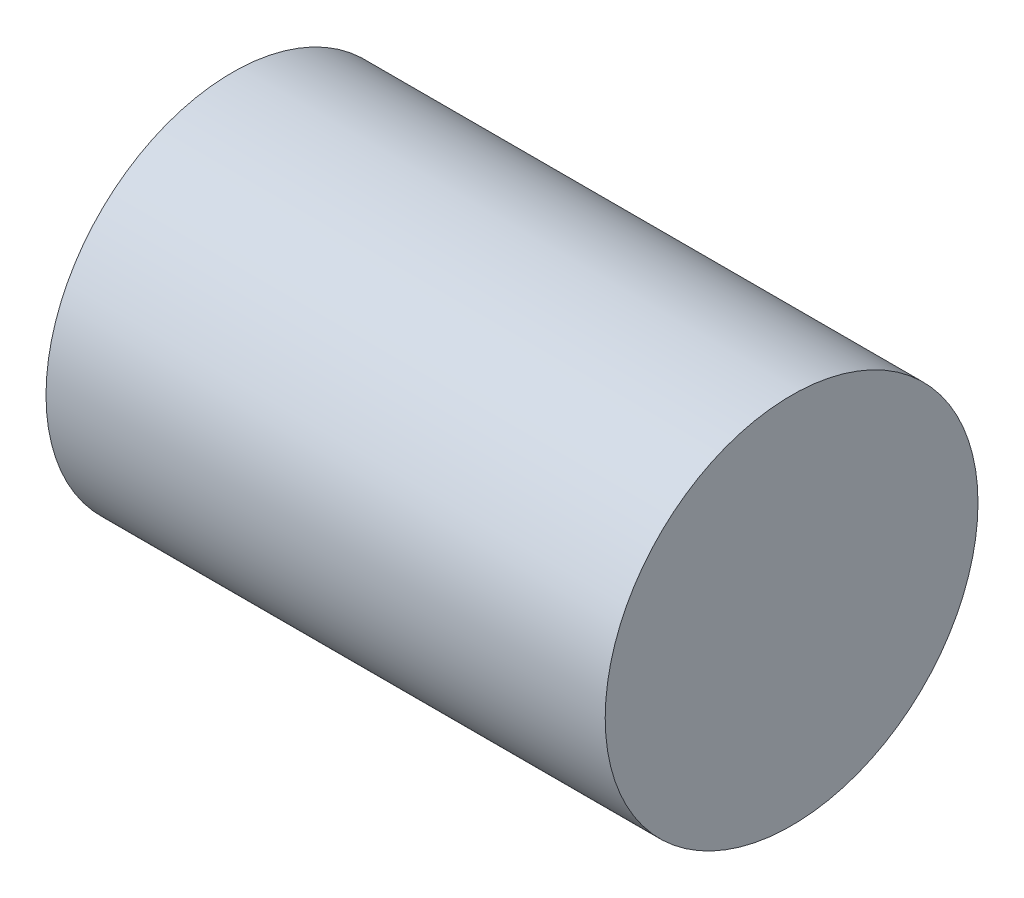
ISO-10303-21;
HEADER;
FILE_DESCRIPTION(('STEP AP214'),'2;1');
FILE_NAME('part.step','',(''),(''),'','','');
FILE_SCHEMA(('AUTOMOTIVE_DESIGN { 1 0 10303 214 1 1 1 1 }'));
ENDSEC;
DATA;
#1=APPLICATION_CONTEXT('core data for automotive mechanical design processes');
#2=APPLICATION_PROTOCOL_DEFINITION('international standard','automotive_design',2000,#1);
#3=PRODUCT_CONTEXT('',#1,'mechanical');
#4=PRODUCT('Part','Part','',(#3));
#5=PRODUCT_RELATED_PRODUCT_CATEGORY('part','',(#4));
#6=PRODUCT_DEFINITION_FORMATION('','',#4);
#7=PRODUCT_DEFINITION_CONTEXT('part definition',#1,'design');
#8=PRODUCT_DEFINITION('design','',#6,#7);
#9=PRODUCT_DEFINITION_SHAPE('','',#8);
#10=(LENGTH_UNIT() NAMED_UNIT(*) SI_UNIT(.MILLI.,.METRE.));
#11=(NAMED_UNIT(*) PLANE_ANGLE_UNIT() SI_UNIT($,.RADIAN.));
#12=(NAMED_UNIT(*) SI_UNIT($,.STERADIAN.) SOLID_ANGLE_UNIT());
#13=UNCERTAINTY_MEASURE_WITH_UNIT(LENGTH_MEASURE(1.E-05),#10,'distance_accuracy_value','');
#14=(GEOMETRIC_REPRESENTATION_CONTEXT(3) GLOBAL_UNCERTAINTY_ASSIGNED_CONTEXT((#13)) GLOBAL_UNIT_ASSIGNED_CONTEXT((#10,
#11,#12)) REPRESENTATION_CONTEXT('',''));
#15=CARTESIAN_POINT('',(0.,0.,0.));
#16=DIRECTION('',(0.,0.,1.));
#17=DIRECTION('',(1.,0.,0.));
#18=AXIS2_PLACEMENT_3D('',#15,#16,#17);
#19=CARTESIAN_POINT('',(15.,0.,0.));
#20=DIRECTION('',(-1.,0.,0.));
#21=DIRECTION('',(0.,0.,1.));
#22=AXIS2_PLACEMENT_3D('',#19,#20,#21);
#23=CYLINDRICAL_SURFACE('',#22,10.);
#24=CARTESIAN_POINT('',(15.,0.,0.));
#25=DIRECTION('',(1.,0.,0.));
#26=DIRECTION('',(0.,0.,-1.));
#27=AXIS2_PLACEMENT_3D('',#24,#25,#26);
#28=CIRCLE('',#27,10.);
#29=CARTESIAN_POINT('',(15.,0.,-10.));
#30=VERTEX_POINT('',#29);
#31=EDGE_CURVE('E10',#30,#30,#28,.T.);
#32=ORIENTED_EDGE('',*,*,#31,.F.);
#33=EDGE_LOOP('',(#32));
#34=FACE_BOUND('',#33,.T.);
#35=CARTESIAN_POINT('',(-15.,0.,0.));
#36=DIRECTION('',(1.,0.,0.));
#37=DIRECTION('',(0.,0.,-1.));
#38=AXIS2_PLACEMENT_3D('',#35,#36,#37);
#39=CIRCLE('',#38,10.);
#40=CARTESIAN_POINT('',(-15.,0.,-10.));
#41=VERTEX_POINT('',#40);
#42=EDGE_CURVE('E34',#41,#41,#39,.T.);
#43=ORIENTED_EDGE('',*,*,#42,.T.);
#44=EDGE_LOOP('',(#43));
#45=FACE_BOUND('',#44,.T.);
#46=ADVANCED_FACE('F31',(#34,#45),#23,.T.);
#47=CARTESIAN_POINT('',(15.,0.,0.));
#48=DIRECTION('',(1.,0.,0.));
#49=DIRECTION('',(0.,0.,-1.));
#50=AXIS2_PLACEMENT_3D('',#47,#48,#49);
#51=PLANE('',#50);
#52=ORIENTED_EDGE('',*,*,#31,.T.);
#53=EDGE_LOOP('',(#52));
#54=FACE_BOUND('',#53,.T.);
#55=ADVANCED_FACE('F46',(#54),#51,.T.);
#56=CARTESIAN_POINT('',(-15.,0.,0.));
#57=DIRECTION('',(1.,0.,0.));
#58=DIRECTION('',(0.,0.,-1.));
#59=AXIS2_PLACEMENT_3D('',#56,#57,#58);
#60=PLANE('',#59);
#61=ORIENTED_EDGE('',*,*,#42,.F.);
#62=EDGE_LOOP('',(#61));
#63=FACE_BOUND('',#62,.T.);
#64=ADVANCED_FACE('F44',(#63),#60,.F.);
#65=CLOSED_SHELL('',(#46,#55,#64));
#66=MANIFOLD_SOLID_BREP('B2',#65);
#67=ADVANCED_BREP_SHAPE_REPRESENTATION('',(#18,#66),#14);
#68=SHAPE_DEFINITION_REPRESENTATION(#9,#67);
ENDSEC;
END-ISO-10303-21;
